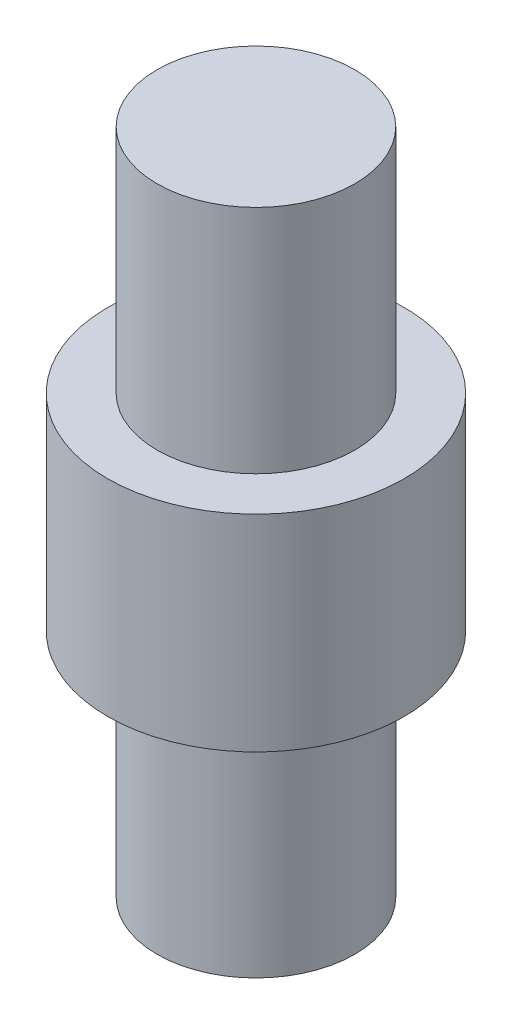
ISO-10303-21;
HEADER;
FILE_DESCRIPTION(('STEP AP214'),'2;1');
FILE_NAME('part.step','',(''),(''),'','','');
FILE_SCHEMA(('AUTOMOTIVE_DESIGN { 1 0 10303 214 1 1 1 1 }'));
ENDSEC;
DATA;
#1=APPLICATION_CONTEXT('core data for automotive mechanical design processes');
#2=APPLICATION_PROTOCOL_DEFINITION('international standard','automotive_design',2000,#1);
#3=PRODUCT_CONTEXT('',#1,'mechanical');
#4=PRODUCT('Part','Part','',(#3));
#5=PRODUCT_RELATED_PRODUCT_CATEGORY('part','',(#4));
#6=PRODUCT_DEFINITION_FORMATION('','',#4);
#7=PRODUCT_DEFINITION_CONTEXT('part definition',#1,'design');
#8=PRODUCT_DEFINITION('design','',#6,#7);
#9=PRODUCT_DEFINITION_SHAPE('','',#8);
#10=(LENGTH_UNIT() NAMED_UNIT(*) SI_UNIT(.MILLI.,.METRE.));
#11=(NAMED_UNIT(*) PLANE_ANGLE_UNIT() SI_UNIT($,.RADIAN.));
#12=(NAMED_UNIT(*) SI_UNIT($,.STERADIAN.) SOLID_ANGLE_UNIT());
#13=UNCERTAINTY_MEASURE_WITH_UNIT(LENGTH_MEASURE(1.E-05),#10,'distance_accuracy_value','');
#14=(GEOMETRIC_REPRESENTATION_CONTEXT(3) GLOBAL_UNCERTAINTY_ASSIGNED_CONTEXT((#13)) GLOBAL_UNIT_ASSIGNED_CONTEXT((#10,
#11,#12)) REPRESENTATION_CONTEXT('',''));
#15=CARTESIAN_POINT('',(0.,0.,0.));
#16=DIRECTION('',(0.,0.,1.));
#17=DIRECTION('',(1.,0.,0.));
#18=AXIS2_PLACEMENT_3D('',#15,#16,#17);
#19=CARTESIAN_POINT('',(0.,-1.5875,0.));
#20=DIRECTION('',(0.,1.,0.));
#21=DIRECTION('',(0.,0.,1.));
#22=AXIS2_PLACEMENT_3D('',#19,#20,#21);
#23=PLANE('',#22);
#24=CARTESIAN_POINT('',(0.,-1.5875,0.));
#25=DIRECTION('',(0.,1.,0.));
#26=DIRECTION('',(0.,0.,1.));
#27=AXIS2_PLACEMENT_3D('',#24,#25,#26);
#28=CIRCLE('',#27,2.286);
#29=CARTESIAN_POINT('',(0.,-1.5875,2.286));
#30=VERTEX_POINT('',#29);
#31=EDGE_CURVE('E45',#30,#30,#28,.T.);
#32=ORIENTED_EDGE('',*,*,#31,.F.);
#33=EDGE_LOOP('',(#32));
#34=FACE_BOUND('',#33,.T.);
#35=CARTESIAN_POINT('',(0.,-1.5875,0.));
#36=DIRECTION('',(0.,1.,0.));
#37=DIRECTION('',(0.,0.,1.));
#38=AXIS2_PLACEMENT_3D('',#35,#36,#37);
#39=CIRCLE('',#38,1.524);
#40=CARTESIAN_POINT('',(0.,-1.5875,1.524));
#41=VERTEX_POINT('',#40);
#42=EDGE_CURVE('E37',#41,#41,#39,.F.);
#43=ORIENTED_EDGE('',*,*,#42,.F.);
#44=EDGE_LOOP('',(#43));
#45=FACE_BOUND('',#44,.T.);
#46=ADVANCED_FACE('F30',(#34,#45),#23,.F.);
#47=CARTESIAN_POINT('',(0.,1.5875,0.));
#48=DIRECTION('',(0.,-1.,0.));
#49=DIRECTION('',(0.,0.,-1.));
#50=AXIS2_PLACEMENT_3D('',#47,#48,#49);
#51=CYLINDRICAL_SURFACE('',#50,2.286);
#52=CARTESIAN_POINT('',(0.,1.5875,0.));
#53=DIRECTION('',(0.,1.,0.));
#54=DIRECTION('',(0.,0.,1.));
#55=AXIS2_PLACEMENT_3D('',#52,#53,#54);
#56=CIRCLE('',#55,2.286);
#57=CARTESIAN_POINT('',(0.,1.5875,2.286));
#58=VERTEX_POINT('',#57);
#59=EDGE_CURVE('E41',#58,#58,#56,.T.);
#60=ORIENTED_EDGE('',*,*,#59,.F.);
#61=EDGE_LOOP('',(#60));
#62=FACE_BOUND('',#61,.T.);
#63=ORIENTED_EDGE('',*,*,#31,.T.);
#64=EDGE_LOOP('',(#63));
#65=FACE_BOUND('',#64,.T.);
#66=ADVANCED_FACE('F32',(#62,#65),#51,.T.);
#67=CARTESIAN_POINT('',(0.,1.5875,0.));
#68=DIRECTION('',(0.,1.,0.));
#69=DIRECTION('',(0.,0.,1.));
#70=AXIS2_PLACEMENT_3D('',#67,#68,#69);
#71=PLANE('',#70);
#72=CARTESIAN_POINT('',(0.,1.5875,0.));
#73=DIRECTION('',(0.,1.,0.));
#74=DIRECTION('',(0.,0.,1.));
#75=AXIS2_PLACEMENT_3D('',#72,#73,#74);
#76=CIRCLE('',#75,1.524);
#77=CARTESIAN_POINT('',(0.,1.5875,1.524));
#78=VERTEX_POINT('',#77);
#79=EDGE_CURVE('E10',#78,#78,#76,.T.);
#80=ORIENTED_EDGE('',*,*,#79,.F.);
#81=EDGE_LOOP('',(#80));
#82=FACE_BOUND('',#81,.T.);
#83=ORIENTED_EDGE('',*,*,#59,.T.);
#84=EDGE_LOOP('',(#83));
#85=FACE_BOUND('',#84,.T.);
#86=ADVANCED_FACE('F72',(#82,#85),#71,.T.);
#87=CARTESIAN_POINT('',(0.,-5.1435,0.));
#88=DIRECTION('',(0.,1.,0.));
#89=DIRECTION('',(0.,0.,1.));
#90=AXIS2_PLACEMENT_3D('',#87,#88,#89);
#91=CYLINDRICAL_SURFACE('',#90,1.524);
#92=CARTESIAN_POINT('',(0.,-5.1435,0.));
#93=DIRECTION('',(0.,-1.,0.));
#94=DIRECTION('',(0.,0.,-1.));
#95=AXIS2_PLACEMENT_3D('',#92,#93,#94);
#96=CIRCLE('',#95,1.524);
#97=CARTESIAN_POINT('',(0.,-5.1435,-1.524));
#98=VERTEX_POINT('',#97);
#99=EDGE_CURVE('E49',#98,#98,#96,.T.);
#100=ORIENTED_EDGE('',*,*,#99,.F.);
#101=EDGE_LOOP('',(#100));
#102=FACE_BOUND('',#101,.T.);
#103=ORIENTED_EDGE('',*,*,#42,.T.);
#104=EDGE_LOOP('',(#103));
#105=FACE_BOUND('',#104,.T.);
#106=ADVANCED_FACE('F79',(#102,#105),#91,.T.);
#107=CARTESIAN_POINT('',(0.,-5.1435,0.));
#108=DIRECTION('',(0.,-1.,0.));
#109=DIRECTION('',(0.,0.,-1.));
#110=AXIS2_PLACEMENT_3D('',#107,#108,#109);
#111=PLANE('',#110);
#112=ORIENTED_EDGE('',*,*,#99,.T.);
#113=EDGE_LOOP('',(#112));
#114=FACE_BOUND('',#113,.T.);
#115=ADVANCED_FACE('F65',(#114),#111,.T.);
#116=CARTESIAN_POINT('',(0.,5.1435,0.));
#117=DIRECTION('',(0.,-1.,0.));
#118=DIRECTION('',(0.,0.,-1.));
#119=AXIS2_PLACEMENT_3D('',#116,#117,#118);
#120=CYLINDRICAL_SURFACE('',#119,1.524);
#121=CARTESIAN_POINT('',(0.,5.1435,0.));
#122=DIRECTION('',(0.,-1.,0.));
#123=DIRECTION('',(0.,0.,-1.));
#124=AXIS2_PLACEMENT_3D('',#121,#122,#123);
#125=CIRCLE('',#124,1.524);
#126=CARTESIAN_POINT('',(0.,5.1435,-1.524));
#127=VERTEX_POINT('',#126);
#128=EDGE_CURVE('E53',#127,#127,#125,.T.);
#129=ORIENTED_EDGE('',*,*,#128,.T.);
#130=EDGE_LOOP('',(#129));
#131=FACE_BOUND('',#130,.T.);
#132=ORIENTED_EDGE('',*,*,#79,.T.);
#133=EDGE_LOOP('',(#132));
#134=FACE_BOUND('',#133,.T.);
#135=ADVANCED_FACE('F57',(#131,#134),#120,.T.);
#136=CARTESIAN_POINT('',(0.,5.1435,0.));
#137=DIRECTION('',(0.,1.,0.));
#138=DIRECTION('',(0.,0.,-1.));
#139=AXIS2_PLACEMENT_3D('',#136,#137,#138);
#140=PLANE('',#139);
#141=ORIENTED_EDGE('',*,*,#128,.F.);
#142=EDGE_LOOP('',(#141));
#143=FACE_BOUND('',#142,.T.);
#144=ADVANCED_FACE('F59',(#143),#140,.T.);
#145=CLOSED_SHELL('',(#46,#66,#86,#106,#115,#135,#144));
#146=MANIFOLD_SOLID_BREP('B2',#145);
#147=ADVANCED_BREP_SHAPE_REPRESENTATION('',(#18,#146),#14);
#148=SHAPE_DEFINITION_REPRESENTATION(#9,#147);
ENDSEC;
END-ISO-10303-21;
